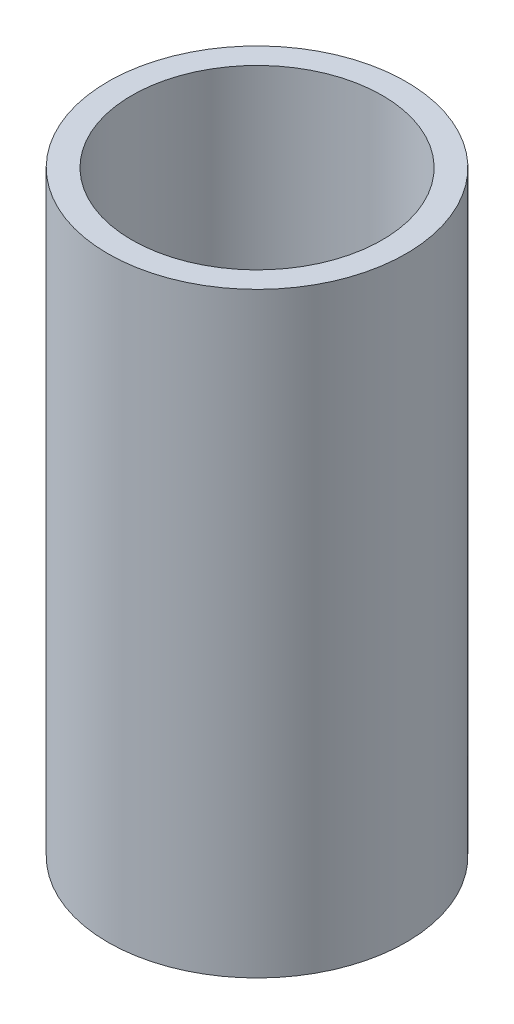
ISO-10303-21;
HEADER;
FILE_DESCRIPTION(('STEP AP214'),'2;1');
FILE_NAME('part.step','',(''),(''),'','','');
FILE_SCHEMA(('AUTOMOTIVE_DESIGN { 1 0 10303 214 1 1 1 1 }'));
ENDSEC;
DATA;
#1=APPLICATION_CONTEXT('core data for automotive mechanical design processes');
#2=APPLICATION_PROTOCOL_DEFINITION('international standard','automotive_design',2000,#1);
#3=PRODUCT_CONTEXT('',#1,'mechanical');
#4=PRODUCT('Part','Part','',(#3));
#5=PRODUCT_RELATED_PRODUCT_CATEGORY('part','',(#4));
#6=PRODUCT_DEFINITION_FORMATION('','',#4);
#7=PRODUCT_DEFINITION_CONTEXT('part definition',#1,'design');
#8=PRODUCT_DEFINITION('design','',#6,#7);
#9=PRODUCT_DEFINITION_SHAPE('','',#8);
#10=(LENGTH_UNIT() NAMED_UNIT(*) SI_UNIT(.MILLI.,.METRE.));
#11=(NAMED_UNIT(*) PLANE_ANGLE_UNIT() SI_UNIT($,.RADIAN.));
#12=(NAMED_UNIT(*) SI_UNIT($,.STERADIAN.) SOLID_ANGLE_UNIT());
#13=UNCERTAINTY_MEASURE_WITH_UNIT(LENGTH_MEASURE(1.E-05),#10,'distance_accuracy_value','');
#14=(GEOMETRIC_REPRESENTATION_CONTEXT(3) GLOBAL_UNCERTAINTY_ASSIGNED_CONTEXT((#13)) GLOBAL_UNIT_ASSIGNED_CONTEXT((#10,
#11,#12)) REPRESENTATION_CONTEXT('',''));
#15=CARTESIAN_POINT('',(0.,0.,0.));
#16=DIRECTION('',(0.,0.,1.));
#17=DIRECTION('',(1.,0.,0.));
#18=AXIS2_PLACEMENT_3D('',#15,#16,#17);
#19=CARTESIAN_POINT('',(0.,10.,0.));
#20=DIRECTION('',(0.,1.,0.));
#21=DIRECTION('',(0.,0.,1.));
#22=AXIS2_PLACEMENT_3D('',#19,#20,#21);
#23=PLANE('',#22);
#24=CARTESIAN_POINT('',(0.,10.,0.));
#25=DIRECTION('',(0.,1.,0.));
#26=DIRECTION('',(0.,0.,1.));
#27=AXIS2_PLACEMENT_3D('',#24,#25,#26);
#28=CIRCLE('',#27,2.5);
#29=CARTESIAN_POINT('',(0.,10.,2.5));
#30=VERTEX_POINT('',#29);
#31=EDGE_CURVE('E10',#30,#30,#28,.T.);
#32=ORIENTED_EDGE('',*,*,#31,.T.);
#33=EDGE_LOOP('',(#32));
#34=FACE_BOUND('',#33,.T.);
#35=CARTESIAN_POINT('',(0.,10.,0.));
#36=DIRECTION('',(0.,1.,0.));
#37=DIRECTION('',(0.,0.,1.));
#38=AXIS2_PLACEMENT_3D('',#35,#36,#37);
#39=CIRCLE('',#38,2.1);
#40=CARTESIAN_POINT('',(0.,10.,2.1));
#41=VERTEX_POINT('',#40);
#42=EDGE_CURVE('E54',#41,#41,#39,.T.);
#43=ORIENTED_EDGE('',*,*,#42,.F.);
#44=EDGE_LOOP('',(#43));
#45=FACE_BOUND('',#44,.T.);
#46=ADVANCED_FACE('F41',(#34,#45),#23,.T.);
#47=CARTESIAN_POINT('',(0.,0.,0.));
#48=DIRECTION('',(0.,1.,0.));
#49=DIRECTION('',(0.,0.,1.));
#50=AXIS2_PLACEMENT_3D('',#47,#48,#49);
#51=PLANE('',#50);
#52=CARTESIAN_POINT('',(0.,0.,0.));
#53=DIRECTION('',(0.,1.,0.));
#54=DIRECTION('',(0.,0.,1.));
#55=AXIS2_PLACEMENT_3D('',#52,#53,#54);
#56=CIRCLE('',#55,2.5);
#57=CARTESIAN_POINT('',(0.,0.,2.5));
#58=VERTEX_POINT('',#57);
#59=EDGE_CURVE('E45',#58,#58,#56,.T.);
#60=ORIENTED_EDGE('',*,*,#59,.F.);
#61=EDGE_LOOP('',(#60));
#62=FACE_BOUND('',#61,.T.);
#63=CARTESIAN_POINT('',(0.,0.,0.));
#64=DIRECTION('',(0.,1.,0.));
#65=DIRECTION('',(0.,0.,1.));
#66=AXIS2_PLACEMENT_3D('',#63,#64,#65);
#67=CIRCLE('',#66,2.1);
#68=CARTESIAN_POINT('',(0.,0.,2.1));
#69=VERTEX_POINT('',#68);
#70=EDGE_CURVE('E56',#69,#69,#67,.T.);
#71=ORIENTED_EDGE('',*,*,#70,.T.);
#72=EDGE_LOOP('',(#71));
#73=FACE_BOUND('',#72,.T.);
#74=ADVANCED_FACE('F68',(#62,#73),#51,.F.);
#75=CARTESIAN_POINT('',(0.,10.,0.));
#76=DIRECTION('',(0.,-1.,0.));
#77=DIRECTION('',(0.,0.,-1.));
#78=AXIS2_PLACEMENT_3D('',#75,#76,#77);
#79=CYLINDRICAL_SURFACE('',#78,2.5);
#80=ORIENTED_EDGE('',*,*,#31,.F.);
#81=EDGE_LOOP('',(#80));
#82=FACE_BOUND('',#81,.T.);
#83=ORIENTED_EDGE('',*,*,#59,.T.);
#84=EDGE_LOOP('',(#83));
#85=FACE_BOUND('',#84,.T.);
#86=ADVANCED_FACE('F43',(#82,#85),#79,.T.);
#87=CARTESIAN_POINT('',(0.,10.,0.));
#88=DIRECTION('',(0.,-1.,0.));
#89=DIRECTION('',(0.,0.,-1.));
#90=AXIS2_PLACEMENT_3D('',#87,#88,#89);
#91=CYLINDRICAL_SURFACE('',#90,2.1);
#92=ORIENTED_EDGE('',*,*,#42,.T.);
#93=EDGE_LOOP('',(#92));
#94=FACE_BOUND('',#93,.T.);
#95=ORIENTED_EDGE('',*,*,#70,.F.);
#96=EDGE_LOOP('',(#95));
#97=FACE_BOUND('',#96,.T.);
#98=ADVANCED_FACE('F64',(#94,#97),#91,.F.);
#99=CLOSED_SHELL('',(#46,#74,#86,#98));
#100=MANIFOLD_SOLID_BREP('B2',#99);
#101=ADVANCED_BREP_SHAPE_REPRESENTATION('',(#18,#100),#14);
#102=SHAPE_DEFINITION_REPRESENTATION(#9,#101);
ENDSEC;
END-ISO-10303-21;
